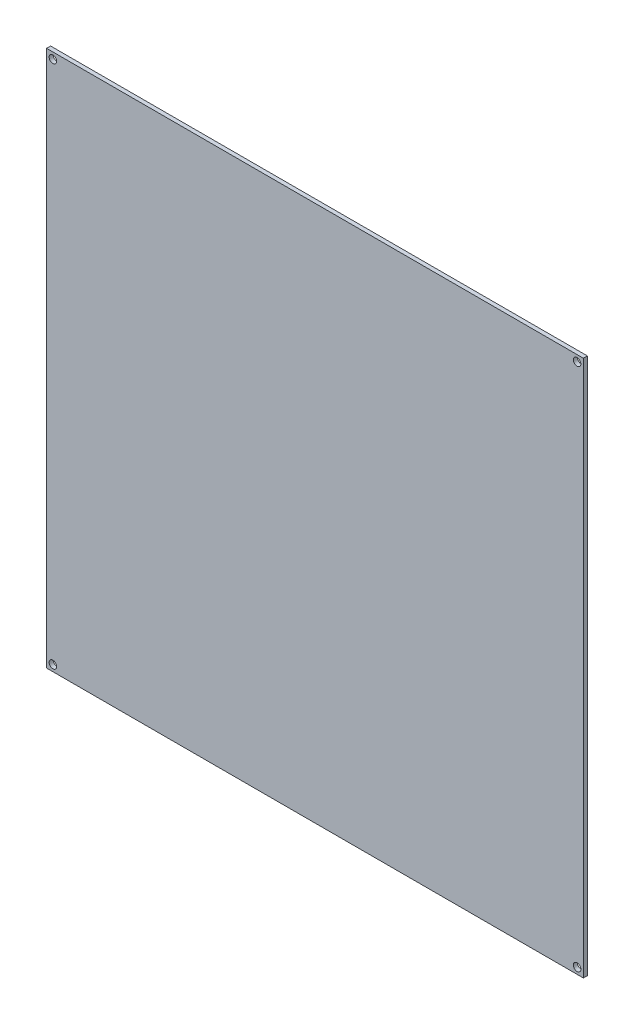
ISO-10303-21;
HEADER;
FILE_DESCRIPTION(('STEP AP214'),'2;1');
FILE_NAME('part.step','',(''),(''),'','','');
FILE_SCHEMA(('AUTOMOTIVE_DESIGN { 1 0 10303 214 1 1 1 1 }'));
ENDSEC;
DATA;
#1=APPLICATION_CONTEXT('core data for automotive mechanical design processes');
#2=APPLICATION_PROTOCOL_DEFINITION('international standard','automotive_design',2000,#1);
#3=PRODUCT_CONTEXT('',#1,'mechanical');
#4=PRODUCT('Part','Part','',(#3));
#5=PRODUCT_RELATED_PRODUCT_CATEGORY('part','',(#4));
#6=PRODUCT_DEFINITION_FORMATION('','',#4);
#7=PRODUCT_DEFINITION_CONTEXT('part definition',#1,'design');
#8=PRODUCT_DEFINITION('design','',#6,#7);
#9=PRODUCT_DEFINITION_SHAPE('','',#8);
#10=(LENGTH_UNIT() NAMED_UNIT(*) SI_UNIT(.MILLI.,.METRE.));
#11=(NAMED_UNIT(*) PLANE_ANGLE_UNIT() SI_UNIT($,.RADIAN.));
#12=(NAMED_UNIT(*) SI_UNIT($,.STERADIAN.) SOLID_ANGLE_UNIT());
#13=UNCERTAINTY_MEASURE_WITH_UNIT(LENGTH_MEASURE(1.E-05),#10,'distance_accuracy_value','');
#14=(GEOMETRIC_REPRESENTATION_CONTEXT(3) GLOBAL_UNCERTAINTY_ASSIGNED_CONTEXT((#13)) GLOBAL_UNIT_ASSIGNED_CONTEXT((#10,
#11,#12)) REPRESENTATION_CONTEXT('',''));
#15=CARTESIAN_POINT('',(0.,0.,0.));
#16=DIRECTION('',(0.,0.,1.));
#17=DIRECTION('',(1.,0.,0.));
#18=AXIS2_PLACEMENT_3D('',#15,#16,#17);
#19=CARTESIAN_POINT('',(107.,107.,1.6));
#20=DIRECTION('',(-1.,0.,0.));
#21=DIRECTION('',(0.,-1.,0.));
#22=AXIS2_PLACEMENT_3D('',#19,#20,#21);
#23=PLANE('',#22);
#24=DIRECTION('',(0.,1.,0.));
#25=VECTOR('',#24,1.);
#26=CARTESIAN_POINT('',(107.,107.,0.));
#27=LINE('',#26,#25);
#28=CARTESIAN_POINT('',(107.,-107.,0.));
#29=VERTEX_POINT('',#28);
#30=CARTESIAN_POINT('',(107.,107.,0.));
#31=VERTEX_POINT('',#30);
#32=EDGE_CURVE('E78',#29,#31,#27,.T.);
#33=ORIENTED_EDGE('',*,*,#32,.T.);
#34=DIRECTION('',(0.,0.,-1.));
#35=VECTOR('',#34,1.);
#36=CARTESIAN_POINT('',(107.,107.,1.6));
#37=LINE('',#36,#35);
#38=CARTESIAN_POINT('',(107.,107.,1.6));
#39=VERTEX_POINT('',#38);
#40=EDGE_CURVE('E10',#39,#31,#37,.T.);
#41=ORIENTED_EDGE('',*,*,#40,.F.);
#42=DIRECTION('',(0.,1.,0.));
#43=VECTOR('',#42,1.);
#44=CARTESIAN_POINT('',(107.,107.,1.6));
#45=LINE('',#44,#43);
#46=CARTESIAN_POINT('',(107.,-107.,1.6));
#47=VERTEX_POINT('',#46);
#48=EDGE_CURVE('E66',#47,#39,#45,.T.);
#49=ORIENTED_EDGE('',*,*,#48,.F.);
#50=DIRECTION('',(0.,0.,-1.));
#51=VECTOR('',#50,1.);
#52=CARTESIAN_POINT('',(107.,-107.,1.6));
#53=LINE('',#52,#51);
#54=EDGE_CURVE('E74',#47,#29,#53,.T.);
#55=ORIENTED_EDGE('',*,*,#54,.T.);
#56=EDGE_LOOP('',(#33,#41,#49,#55));
#57=FACE_BOUND('',#56,.T.);
#58=ADVANCED_FACE('F15',(#57),#23,.F.);
#59=CARTESIAN_POINT('',(-107.,107.,1.6));
#60=DIRECTION('',(0.,-1.,0.));
#61=DIRECTION('',(0.,0.,-1.));
#62=AXIS2_PLACEMENT_3D('',#59,#60,#61);
#63=PLANE('',#62);
#64=DIRECTION('',(-1.,0.,0.));
#65=VECTOR('',#64,1.);
#66=CARTESIAN_POINT('',(-107.,107.,0.));
#67=LINE('',#66,#65);
#68=CARTESIAN_POINT('',(-107.,107.,0.));
#69=VERTEX_POINT('',#68);
#70=EDGE_CURVE('E70',#31,#69,#67,.T.);
#71=ORIENTED_EDGE('',*,*,#70,.T.);
#72=DIRECTION('',(0.,0.,-1.));
#73=VECTOR('',#72,1.);
#74=CARTESIAN_POINT('',(-107.,107.,1.6));
#75=LINE('',#74,#73);
#76=CARTESIAN_POINT('',(-107.,107.,1.6));
#77=VERTEX_POINT('',#76);
#78=EDGE_CURVE('E23',#77,#69,#75,.T.);
#79=ORIENTED_EDGE('',*,*,#78,.F.);
#80=DIRECTION('',(-1.,0.,0.));
#81=VECTOR('',#80,1.);
#82=CARTESIAN_POINT('',(-107.,107.,1.6));
#83=LINE('',#82,#81);
#84=EDGE_CURVE('E61',#39,#77,#83,.T.);
#85=ORIENTED_EDGE('',*,*,#84,.F.);
#86=ORIENTED_EDGE('',*,*,#40,.T.);
#87=EDGE_LOOP('',(#71,#79,#85,#86));
#88=FACE_BOUND('',#87,.T.);
#89=ADVANCED_FACE('F69',(#88),#63,.F.);
#90=CARTESIAN_POINT('',(-107.,107.,1.6));
#91=DIRECTION('',(1.,0.,0.));
#92=DIRECTION('',(0.,1.,0.));
#93=AXIS2_PLACEMENT_3D('',#90,#91,#92);
#94=PLANE('',#93);
#95=DIRECTION('',(0.,-1.,0.));
#96=VECTOR('',#95,1.);
#97=CARTESIAN_POINT('',(-107.,107.,0.));
#98=LINE('',#97,#96);
#99=CARTESIAN_POINT('',(-107.,-107.,0.));
#100=VERTEX_POINT('',#99);
#101=EDGE_CURVE('E48',#69,#100,#98,.T.);
#102=ORIENTED_EDGE('',*,*,#101,.T.);
#103=DIRECTION('',(0.,0.,-1.));
#104=VECTOR('',#103,1.);
#105=CARTESIAN_POINT('',(-107.,-107.,1.6));
#106=LINE('',#105,#104);
#107=CARTESIAN_POINT('',(-107.,-107.,1.6));
#108=VERTEX_POINT('',#107);
#109=EDGE_CURVE('E71',#108,#100,#106,.T.);
#110=ORIENTED_EDGE('',*,*,#109,.F.);
#111=DIRECTION('',(0.,-1.,0.));
#112=VECTOR('',#111,1.);
#113=CARTESIAN_POINT('',(-107.,107.,1.6));
#114=LINE('',#113,#112);
#115=EDGE_CURVE('E64',#77,#108,#114,.T.);
#116=ORIENTED_EDGE('',*,*,#115,.F.);
#117=ORIENTED_EDGE('',*,*,#78,.T.);
#118=EDGE_LOOP('',(#102,#110,#116,#117));
#119=FACE_BOUND('',#118,.T.);
#120=ADVANCED_FACE('F72',(#119),#94,.F.);
#121=CARTESIAN_POINT('',(-107.,-107.,1.6));
#122=DIRECTION('',(0.,1.,0.));
#123=DIRECTION('',(0.,0.,1.));
#124=AXIS2_PLACEMENT_3D('',#121,#122,#123);
#125=PLANE('',#124);
#126=DIRECTION('',(1.,0.,0.));
#127=VECTOR('',#126,1.);
#128=CARTESIAN_POINT('',(-107.,-107.,0.));
#129=LINE('',#128,#127);
#130=EDGE_CURVE('E54',#100,#29,#129,.T.);
#131=ORIENTED_EDGE('',*,*,#130,.T.);
#132=ORIENTED_EDGE('',*,*,#54,.F.);
#133=DIRECTION('',(1.,0.,0.));
#134=VECTOR('',#133,1.);
#135=CARTESIAN_POINT('',(-107.,-107.,1.6));
#136=LINE('',#135,#134);
#137=EDGE_CURVE('E31',#108,#47,#136,.T.);
#138=ORIENTED_EDGE('',*,*,#137,.F.);
#139=ORIENTED_EDGE('',*,*,#109,.T.);
#140=EDGE_LOOP('',(#131,#132,#138,#139));
#141=FACE_BOUND('',#140,.T.);
#142=ADVANCED_FACE('F86',(#141),#125,.F.);
#143=CARTESIAN_POINT('',(0.,0.,1.6));
#144=DIRECTION('',(0.,0.,1.));
#145=DIRECTION('',(1.,0.,0.));
#146=AXIS2_PLACEMENT_3D('',#143,#144,#145);
#147=PLANE('',#146);
#148=CARTESIAN_POINT('',(-104.499999999994,-104.5,1.6));
#149=DIRECTION('',(0.,0.,1.));
#150=DIRECTION('',(1.,0.,0.));
#151=AXIS2_PLACEMENT_3D('',#148,#149,#150);
#152=CIRCLE('',#151,1.50000000000309);
#153=CARTESIAN_POINT('',(-102.999999999991,-104.5,1.6));
#154=VERTEX_POINT('',#153);
#155=EDGE_CURVE('E102',#154,#154,#152,.T.);
#156=ORIENTED_EDGE('',*,*,#155,.F.);
#157=EDGE_LOOP('',(#156));
#158=FACE_BOUND('',#157,.T.);
#159=CARTESIAN_POINT('',(104.500000000006,-104.499999999994,1.6));
#160=DIRECTION('',(0.,0.,1.));
#161=DIRECTION('',(1.,0.,0.));
#162=AXIS2_PLACEMENT_3D('',#159,#160,#161);
#163=CIRCLE('',#162,1.50000000000829);
#164=CARTESIAN_POINT('',(106.000000000014,-104.499999999994,1.6));
#165=VERTEX_POINT('',#164);
#166=EDGE_CURVE('E101',#165,#165,#163,.T.);
#167=ORIENTED_EDGE('',*,*,#166,.F.);
#168=EDGE_LOOP('',(#167));
#169=FACE_BOUND('',#168,.T.);
#170=CARTESIAN_POINT('',(104.5,104.500000000006,1.6));
#171=DIRECTION('',(0.,0.,1.));
#172=DIRECTION('',(1.,0.,0.));
#173=AXIS2_PLACEMENT_3D('',#170,#171,#172);
#174=CIRCLE('',#173,1.50000000000604);
#175=CARTESIAN_POINT('',(106.000000000006,104.500000000006,1.6));
#176=VERTEX_POINT('',#175);
#177=EDGE_CURVE('E108',#176,#176,#174,.T.);
#178=ORIENTED_EDGE('',*,*,#177,.F.);
#179=EDGE_LOOP('',(#178));
#180=FACE_BOUND('',#179,.T.);
#181=CARTESIAN_POINT('',(-104.5,104.5,1.6));
#182=DIRECTION('',(0.,0.,1.));
#183=DIRECTION('',(1.,0.,0.));
#184=AXIS2_PLACEMENT_3D('',#181,#182,#183);
#185=CIRCLE('',#184,1.5);
#186=CARTESIAN_POINT('',(-103.,104.5,1.6));
#187=VERTEX_POINT('',#186);
#188=EDGE_CURVE('E94',#187,#187,#185,.T.);
#189=ORIENTED_EDGE('',*,*,#188,.F.);
#190=EDGE_LOOP('',(#189));
#191=FACE_BOUND('',#190,.T.);
#192=ORIENTED_EDGE('',*,*,#48,.T.);
#193=ORIENTED_EDGE('',*,*,#84,.T.);
#194=ORIENTED_EDGE('',*,*,#115,.T.);
#195=ORIENTED_EDGE('',*,*,#137,.T.);
#196=EDGE_LOOP('',(#192,#193,#194,#195));
#197=FACE_BOUND('',#196,.T.);
#198=ADVANCED_FACE('F62',(#158,#169,#180,#191,#197),#147,.T.);
#199=CARTESIAN_POINT('',(0.,0.,0.));
#200=DIRECTION('',(0.,0.,1.));
#201=DIRECTION('',(1.,0.,0.));
#202=AXIS2_PLACEMENT_3D('',#199,#200,#201);
#203=PLANE('',#202);
#204=CARTESIAN_POINT('',(-104.499999999994,-104.5,0.));
#205=DIRECTION('',(0.,0.,1.));
#206=DIRECTION('',(1.,0.,0.));
#207=AXIS2_PLACEMENT_3D('',#204,#205,#206);
#208=CIRCLE('',#207,1.50000000000309);
#209=CARTESIAN_POINT('',(-102.999999999991,-104.5,0.));
#210=VERTEX_POINT('',#209);
#211=EDGE_CURVE('E98',#210,#210,#208,.F.);
#212=ORIENTED_EDGE('',*,*,#211,.F.);
#213=EDGE_LOOP('',(#212));
#214=FACE_BOUND('',#213,.T.);
#215=CARTESIAN_POINT('',(104.500000000006,-104.499999999994,0.));
#216=DIRECTION('',(0.,0.,1.));
#217=DIRECTION('',(1.,0.,0.));
#218=AXIS2_PLACEMENT_3D('',#215,#216,#217);
#219=CIRCLE('',#218,1.50000000000829);
#220=CARTESIAN_POINT('',(106.000000000014,-104.499999999994,0.));
#221=VERTEX_POINT('',#220);
#222=EDGE_CURVE('E105',#221,#221,#219,.F.);
#223=ORIENTED_EDGE('',*,*,#222,.F.);
#224=EDGE_LOOP('',(#223));
#225=FACE_BOUND('',#224,.T.);
#226=CARTESIAN_POINT('',(104.5,104.500000000006,0.));
#227=DIRECTION('',(0.,0.,1.));
#228=DIRECTION('',(1.,0.,0.));
#229=AXIS2_PLACEMENT_3D('',#226,#227,#228);
#230=CIRCLE('',#229,1.50000000000604);
#231=CARTESIAN_POINT('',(106.000000000006,104.500000000006,0.));
#232=VERTEX_POINT('',#231);
#233=EDGE_CURVE('E97',#232,#232,#230,.F.);
#234=ORIENTED_EDGE('',*,*,#233,.F.);
#235=EDGE_LOOP('',(#234));
#236=FACE_BOUND('',#235,.T.);
#237=CARTESIAN_POINT('',(-104.5,104.5,0.));
#238=DIRECTION('',(0.,0.,1.));
#239=DIRECTION('',(1.,0.,0.));
#240=AXIS2_PLACEMENT_3D('',#237,#238,#239);
#241=CIRCLE('',#240,1.5);
#242=CARTESIAN_POINT('',(-103.,104.5,0.));
#243=VERTEX_POINT('',#242);
#244=EDGE_CURVE('E81',#243,#243,#241,.F.);
#245=ORIENTED_EDGE('',*,*,#244,.F.);
#246=EDGE_LOOP('',(#245));
#247=FACE_BOUND('',#246,.T.);
#248=ORIENTED_EDGE('',*,*,#32,.F.);
#249=ORIENTED_EDGE('',*,*,#130,.F.);
#250=ORIENTED_EDGE('',*,*,#101,.F.);
#251=ORIENTED_EDGE('',*,*,#70,.F.);
#252=EDGE_LOOP('',(#248,#249,#250,#251));
#253=FACE_BOUND('',#252,.T.);
#254=ADVANCED_FACE('F89',(#214,#225,#236,#247,#253),#203,.F.);
#255=CARTESIAN_POINT('',(-104.5,104.5,-4.24264068714272));
#256=DIRECTION('',(0.,0.,1.));
#257=DIRECTION('',(1.,0.,0.));
#258=AXIS2_PLACEMENT_3D('',#255,#256,#257);
#259=CYLINDRICAL_SURFACE('',#258,1.5);
#260=ORIENTED_EDGE('',*,*,#244,.T.);
#261=EDGE_LOOP('',(#260));
#262=FACE_BOUND('',#261,.T.);
#263=ORIENTED_EDGE('',*,*,#188,.T.);
#264=EDGE_LOOP('',(#263));
#265=FACE_BOUND('',#264,.T.);
#266=ADVANCED_FACE('F124',(#262,#265),#259,.F.);
#267=CARTESIAN_POINT('',(104.5,104.500000000006,-4.24264068714272));
#268=DIRECTION('',(0.,0.,1.));
#269=DIRECTION('',(1.,0.,0.));
#270=AXIS2_PLACEMENT_3D('',#267,#268,#269);
#271=CYLINDRICAL_SURFACE('',#270,1.50000000000604);
#272=ORIENTED_EDGE('',*,*,#233,.T.);
#273=EDGE_LOOP('',(#272));
#274=FACE_BOUND('',#273,.T.);
#275=ORIENTED_EDGE('',*,*,#177,.T.);
#276=EDGE_LOOP('',(#275));
#277=FACE_BOUND('',#276,.T.);
#278=ADVANCED_FACE('F116',(#274,#277),#271,.F.);
#279=CARTESIAN_POINT('',(104.500000000006,-104.499999999994,-4.24264068714272));
#280=DIRECTION('',(0.,0.,1.));
#281=DIRECTION('',(1.,0.,0.));
#282=AXIS2_PLACEMENT_3D('',#279,#280,#281);
#283=CYLINDRICAL_SURFACE('',#282,1.50000000000829);
#284=ORIENTED_EDGE('',*,*,#222,.T.);
#285=EDGE_LOOP('',(#284));
#286=FACE_BOUND('',#285,.T.);
#287=ORIENTED_EDGE('',*,*,#166,.T.);
#288=EDGE_LOOP('',(#287));
#289=FACE_BOUND('',#288,.T.);
#290=ADVANCED_FACE('F133',(#286,#289),#283,.F.);
#291=CARTESIAN_POINT('',(-104.499999999994,-104.5,-4.24264068714272));
#292=DIRECTION('',(0.,0.,1.));
#293=DIRECTION('',(1.,0.,0.));
#294=AXIS2_PLACEMENT_3D('',#291,#292,#293);
#295=CYLINDRICAL_SURFACE('',#294,1.50000000000309);
#296=ORIENTED_EDGE('',*,*,#211,.T.);
#297=EDGE_LOOP('',(#296));
#298=FACE_BOUND('',#297,.T.);
#299=ORIENTED_EDGE('',*,*,#155,.T.);
#300=EDGE_LOOP('',(#299));
#301=FACE_BOUND('',#300,.T.);
#302=ADVANCED_FACE('F189',(#298,#301),#295,.F.);
#303=CLOSED_SHELL('',(#58,#89,#120,#142,#198,#254,#266,#278,#290,#302));
#304=MANIFOLD_SOLID_BREP('B1',#303);
#305=ADVANCED_BREP_SHAPE_REPRESENTATION('',(#18,#304),#14);
#306=SHAPE_DEFINITION_REPRESENTATION(#9,#305);
ENDSEC;
END-ISO-10303-21;
